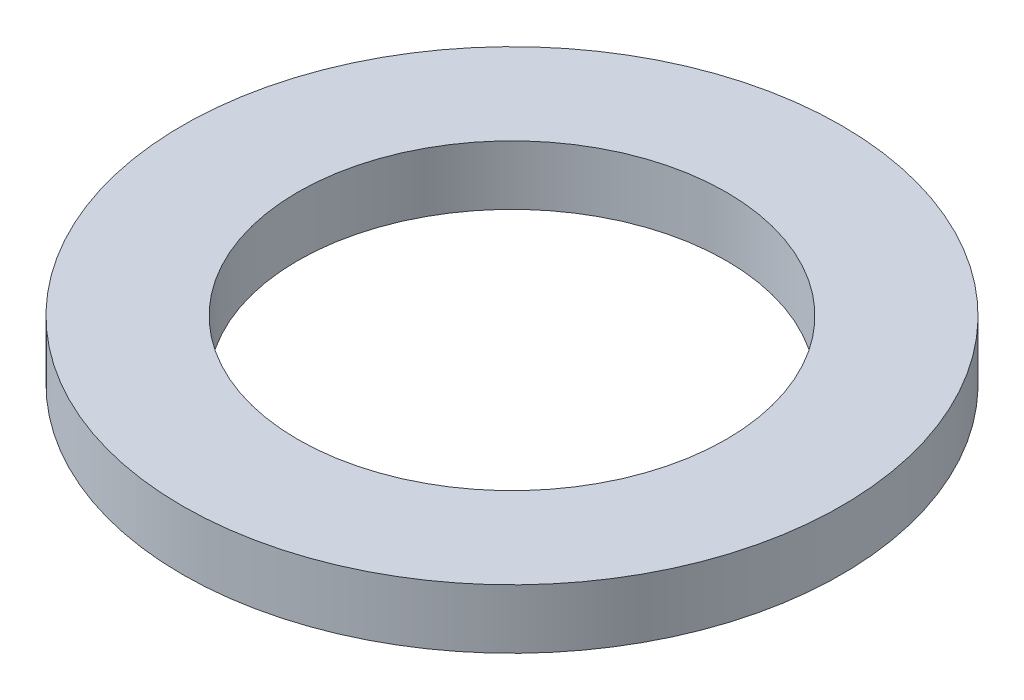
ISO-10303-21;
HEADER;
FILE_DESCRIPTION(('STEP AP214'),'2;1');
FILE_NAME('part.step','',(''),(''),'','','');
FILE_SCHEMA(('AUTOMOTIVE_DESIGN { 1 0 10303 214 1 1 1 1 }'));
ENDSEC;
DATA;
#1=APPLICATION_CONTEXT('core data for automotive mechanical design processes');
#2=APPLICATION_PROTOCOL_DEFINITION('international standard','automotive_design',2000,#1);
#3=PRODUCT_CONTEXT('',#1,'mechanical');
#4=PRODUCT('Part','Part','',(#3));
#5=PRODUCT_RELATED_PRODUCT_CATEGORY('part','',(#4));
#6=PRODUCT_DEFINITION_FORMATION('','',#4);
#7=PRODUCT_DEFINITION_CONTEXT('part definition',#1,'design');
#8=PRODUCT_DEFINITION('design','',#6,#7);
#9=PRODUCT_DEFINITION_SHAPE('','',#8);
#10=(LENGTH_UNIT() NAMED_UNIT(*) SI_UNIT(.MILLI.,.METRE.));
#11=(NAMED_UNIT(*) PLANE_ANGLE_UNIT() SI_UNIT($,.RADIAN.));
#12=(NAMED_UNIT(*) SI_UNIT($,.STERADIAN.) SOLID_ANGLE_UNIT());
#13=UNCERTAINTY_MEASURE_WITH_UNIT(LENGTH_MEASURE(1.E-05),#10,'distance_accuracy_value','');
#14=(GEOMETRIC_REPRESENTATION_CONTEXT(3) GLOBAL_UNCERTAINTY_ASSIGNED_CONTEXT((#13)) GLOBAL_UNIT_ASSIGNED_CONTEXT((#10,
#11,#12)) REPRESENTATION_CONTEXT('',''));
#15=CARTESIAN_POINT('',(0.,0.,0.));
#16=DIRECTION('',(0.,0.,1.));
#17=DIRECTION('',(1.,0.,0.));
#18=AXIS2_PLACEMENT_3D('',#15,#16,#17);
#19=CARTESIAN_POINT('',(0.,9.,0.));
#20=DIRECTION('',(0.,-1.,0.));
#21=DIRECTION('',(0.,0.,-1.));
#22=AXIS2_PLACEMENT_3D('',#19,#20,#21);
#23=CYLINDRICAL_SURFACE('',#22,50.);
#24=CARTESIAN_POINT('',(0.,9.,0.));
#25=DIRECTION('',(0.,1.,0.));
#26=DIRECTION('',(0.,0.,1.));
#27=AXIS2_PLACEMENT_3D('',#24,#25,#26);
#28=CIRCLE('',#27,50.);
#29=CARTESIAN_POINT('',(0.,9.,50.));
#30=VERTEX_POINT('',#29);
#31=EDGE_CURVE('E10',#30,#30,#28,.T.);
#32=ORIENTED_EDGE('',*,*,#31,.F.);
#33=EDGE_LOOP('',(#32));
#34=FACE_BOUND('',#33,.T.);
#35=CARTESIAN_POINT('',(0.,0.,0.));
#36=DIRECTION('',(0.,1.,0.));
#37=DIRECTION('',(0.,0.,1.));
#38=AXIS2_PLACEMENT_3D('',#35,#36,#37);
#39=CIRCLE('',#38,50.);
#40=CARTESIAN_POINT('',(0.,0.,50.));
#41=VERTEX_POINT('',#40);
#42=EDGE_CURVE('E37',#41,#41,#39,.T.);
#43=ORIENTED_EDGE('',*,*,#42,.T.);
#44=EDGE_LOOP('',(#43));
#45=FACE_BOUND('',#44,.T.);
#46=ADVANCED_FACE('F40',(#34,#45),#23,.T.);
#47=CARTESIAN_POINT('',(0.,9.,0.));
#48=DIRECTION('',(0.,1.,0.));
#49=DIRECTION('',(0.,0.,1.));
#50=AXIS2_PLACEMENT_3D('',#47,#48,#49);
#51=PLANE('',#50);
#52=CARTESIAN_POINT('',(0.,9.,0.));
#53=DIRECTION('',(0.,1.,0.));
#54=DIRECTION('',(0.,0.,1.));
#55=AXIS2_PLACEMENT_3D('',#52,#53,#54);
#56=CIRCLE('',#55,32.5);
#57=CARTESIAN_POINT('',(0.,9.,32.5));
#58=VERTEX_POINT('',#57);
#59=EDGE_CURVE('E50',#58,#58,#56,.T.);
#60=ORIENTED_EDGE('',*,*,#59,.F.);
#61=EDGE_LOOP('',(#60));
#62=FACE_BOUND('',#61,.T.);
#63=ORIENTED_EDGE('',*,*,#31,.T.);
#64=EDGE_LOOP('',(#63));
#65=FACE_BOUND('',#64,.T.);
#66=ADVANCED_FACE('F59',(#62,#65),#51,.T.);
#67=CARTESIAN_POINT('',(0.,0.,0.));
#68=DIRECTION('',(0.,1.,0.));
#69=DIRECTION('',(0.,0.,1.));
#70=AXIS2_PLACEMENT_3D('',#67,#68,#69);
#71=PLANE('',#70);
#72=CARTESIAN_POINT('',(0.,0.,0.));
#73=DIRECTION('',(0.,1.,0.));
#74=DIRECTION('',(0.,0.,1.));
#75=AXIS2_PLACEMENT_3D('',#72,#73,#74);
#76=CIRCLE('',#75,32.5);
#77=CARTESIAN_POINT('',(0.,0.,32.5));
#78=VERTEX_POINT('',#77);
#79=EDGE_CURVE('E47',#78,#78,#76,.T.);
#80=ORIENTED_EDGE('',*,*,#79,.T.);
#81=EDGE_LOOP('',(#80));
#82=FACE_BOUND('',#81,.T.);
#83=ORIENTED_EDGE('',*,*,#42,.F.);
#84=EDGE_LOOP('',(#83));
#85=FACE_BOUND('',#84,.T.);
#86=ADVANCED_FACE('F58',(#82,#85),#71,.F.);
#87=CARTESIAN_POINT('',(0.,9.,0.));
#88=DIRECTION('',(0.,-1.,0.));
#89=DIRECTION('',(0.,0.,-1.));
#90=AXIS2_PLACEMENT_3D('',#87,#88,#89);
#91=CYLINDRICAL_SURFACE('',#90,32.5);
#92=ORIENTED_EDGE('',*,*,#59,.T.);
#93=EDGE_LOOP('',(#92));
#94=FACE_BOUND('',#93,.T.);
#95=ORIENTED_EDGE('',*,*,#79,.F.);
#96=EDGE_LOOP('',(#95));
#97=FACE_BOUND('',#96,.T.);
#98=ADVANCED_FACE('F54',(#94,#97),#91,.F.);
#99=CLOSED_SHELL('',(#46,#66,#86,#98));
#100=MANIFOLD_SOLID_BREP('B2',#99);
#101=ADVANCED_BREP_SHAPE_REPRESENTATION('',(#18,#100),#14);
#102=SHAPE_DEFINITION_REPRESENTATION(#9,#101);
ENDSEC;
END-ISO-10303-21;
